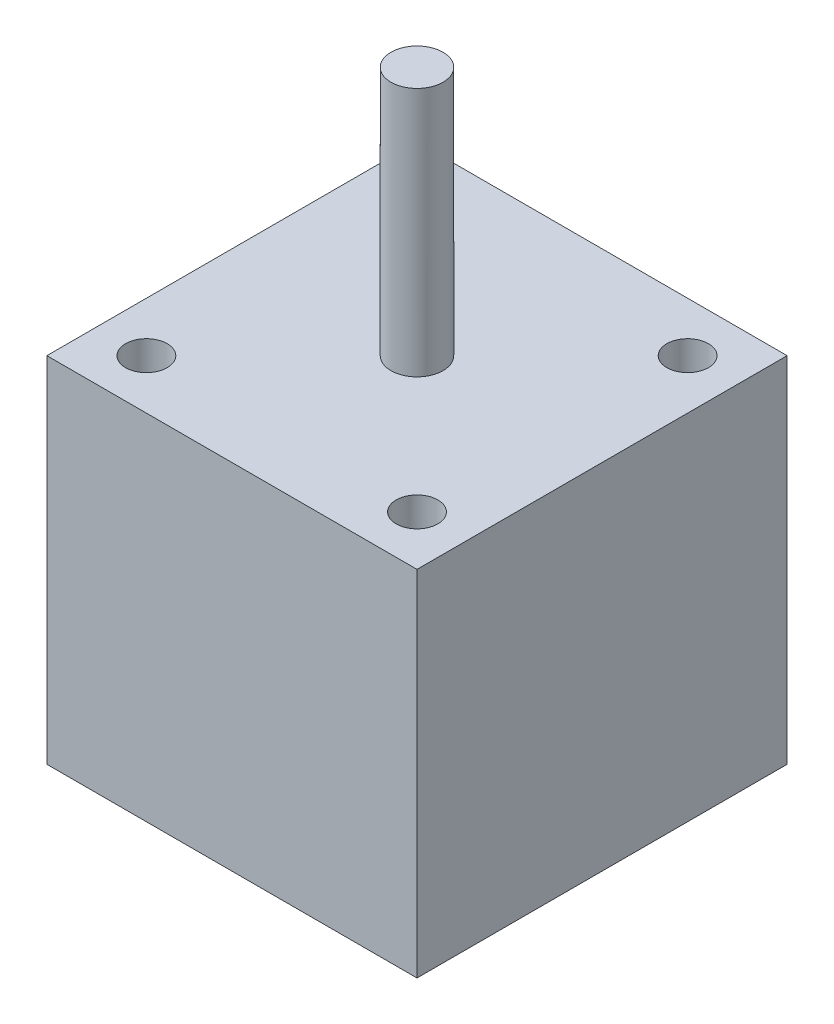
ISO-10303-21;
HEADER;
FILE_DESCRIPTION(('STEP AP214'),'2;1');
FILE_NAME('part.step','',(''),(''),'','','');
FILE_SCHEMA(('AUTOMOTIVE_DESIGN { 1 0 10303 214 1 1 1 1 }'));
ENDSEC;
DATA;
#1=APPLICATION_CONTEXT('core data for automotive mechanical design processes');
#2=APPLICATION_PROTOCOL_DEFINITION('international standard','automotive_design',2000,#1);
#3=PRODUCT_CONTEXT('',#1,'mechanical');
#4=PRODUCT('Part','Part','',(#3));
#5=PRODUCT_RELATED_PRODUCT_CATEGORY('part','',(#4));
#6=PRODUCT_DEFINITION_FORMATION('','',#4);
#7=PRODUCT_DEFINITION_CONTEXT('part definition',#1,'design');
#8=PRODUCT_DEFINITION('design','',#6,#7);
#9=PRODUCT_DEFINITION_SHAPE('','',#8);
#10=(LENGTH_UNIT() NAMED_UNIT(*) SI_UNIT(.MILLI.,.METRE.));
#11=(NAMED_UNIT(*) PLANE_ANGLE_UNIT() SI_UNIT($,.RADIAN.));
#12=(NAMED_UNIT(*) SI_UNIT($,.STERADIAN.) SOLID_ANGLE_UNIT());
#13=UNCERTAINTY_MEASURE_WITH_UNIT(LENGTH_MEASURE(1.E-05),#10,'distance_accuracy_value','');
#14=(GEOMETRIC_REPRESENTATION_CONTEXT(3) GLOBAL_UNCERTAINTY_ASSIGNED_CONTEXT((#13)) GLOBAL_UNIT_ASSIGNED_CONTEXT((#10,
#11,#12)) REPRESENTATION_CONTEXT('',''));
#15=CARTESIAN_POINT('',(0.,0.,0.));
#16=DIRECTION('',(0.,0.,1.));
#17=DIRECTION('',(1.,0.,0.));
#18=AXIS2_PLACEMENT_3D('',#15,#16,#17);
#19=CARTESIAN_POINT('',(17.78,34.,17.78));
#20=DIRECTION('',(-1.,0.,0.));
#21=DIRECTION('',(0.,0.,1.));
#22=AXIS2_PLACEMENT_3D('',#19,#20,#21);
#23=PLANE('',#22);
#24=DIRECTION('',(0.,0.,-1.));
#25=VECTOR('',#24,1.);
#26=CARTESIAN_POINT('',(17.78,0.,17.78));
#27=LINE('',#26,#25);
#28=CARTESIAN_POINT('',(17.78,0.,17.78));
#29=VERTEX_POINT('',#28);
#30=CARTESIAN_POINT('',(17.78,0.,-17.78));
#31=VERTEX_POINT('',#30);
#32=EDGE_CURVE('E112',#29,#31,#27,.T.);
#33=ORIENTED_EDGE('',*,*,#32,.T.);
#34=DIRECTION('',(0.,-1.,0.));
#35=VECTOR('',#34,1.);
#36=CARTESIAN_POINT('',(17.78,34.,-17.78));
#37=LINE('',#36,#35);
#38=CARTESIAN_POINT('',(17.78,34.,-17.78));
#39=VERTEX_POINT('',#38);
#40=EDGE_CURVE('E50',#39,#31,#37,.T.);
#41=ORIENTED_EDGE('',*,*,#40,.F.);
#42=DIRECTION('',(0.,0.,-1.));
#43=VECTOR('',#42,1.);
#44=CARTESIAN_POINT('',(17.78,34.,17.78));
#45=LINE('',#44,#43);
#46=CARTESIAN_POINT('',(17.78,34.,17.78));
#47=VERTEX_POINT('',#46);
#48=EDGE_CURVE('E94',#47,#39,#45,.T.);
#49=ORIENTED_EDGE('',*,*,#48,.F.);
#50=DIRECTION('',(0.,-1.,0.));
#51=VECTOR('',#50,1.);
#52=CARTESIAN_POINT('',(17.78,34.,17.78));
#53=LINE('',#52,#51);
#54=EDGE_CURVE('E108',#47,#29,#53,.T.);
#55=ORIENTED_EDGE('',*,*,#54,.T.);
#56=EDGE_LOOP('',(#33,#41,#49,#55));
#57=FACE_BOUND('',#56,.T.);
#58=ADVANCED_FACE('F41',(#57),#23,.F.);
#59=CARTESIAN_POINT('',(-17.78,34.,-17.78));
#60=DIRECTION('',(0.,0.,1.));
#61=DIRECTION('',(1.,0.,0.));
#62=AXIS2_PLACEMENT_3D('',#59,#60,#61);
#63=PLANE('',#62);
#64=DIRECTION('',(-1.,0.,0.));
#65=VECTOR('',#64,1.);
#66=CARTESIAN_POINT('',(-17.78,0.,-17.78));
#67=LINE('',#66,#65);
#68=CARTESIAN_POINT('',(-17.78,0.,-17.78));
#69=VERTEX_POINT('',#68);
#70=EDGE_CURVE('E100',#31,#69,#67,.T.);
#71=ORIENTED_EDGE('',*,*,#70,.T.);
#72=DIRECTION('',(0.,-1.,0.));
#73=VECTOR('',#72,1.);
#74=CARTESIAN_POINT('',(-17.78,34.,-17.78));
#75=LINE('',#74,#73);
#76=CARTESIAN_POINT('',(-17.78,34.,-17.78));
#77=VERTEX_POINT('',#76);
#78=EDGE_CURVE('E98',#77,#69,#75,.T.);
#79=ORIENTED_EDGE('',*,*,#78,.F.);
#80=DIRECTION('',(-1.,0.,0.));
#81=VECTOR('',#80,1.);
#82=CARTESIAN_POINT('',(-17.78,34.,-17.78));
#83=LINE('',#82,#81);
#84=EDGE_CURVE('E89',#39,#77,#83,.T.);
#85=ORIENTED_EDGE('',*,*,#84,.F.);
#86=ORIENTED_EDGE('',*,*,#40,.T.);
#87=EDGE_LOOP('',(#71,#79,#85,#86));
#88=FACE_BOUND('',#87,.T.);
#89=ADVANCED_FACE('F99',(#88),#63,.F.);
#90=CARTESIAN_POINT('',(-17.78,34.,17.78));
#91=DIRECTION('',(1.,0.,0.));
#92=DIRECTION('',(0.,0.,-1.));
#93=AXIS2_PLACEMENT_3D('',#90,#91,#92);
#94=PLANE('',#93);
#95=DIRECTION('',(0.,0.,1.));
#96=VECTOR('',#95,1.);
#97=CARTESIAN_POINT('',(-17.78,0.,17.78));
#98=LINE('',#97,#96);
#99=CARTESIAN_POINT('',(-17.78,0.,17.78));
#100=VERTEX_POINT('',#99);
#101=EDGE_CURVE('E75',#69,#100,#98,.T.);
#102=ORIENTED_EDGE('',*,*,#101,.T.);
#103=DIRECTION('',(0.,-1.,0.));
#104=VECTOR('',#103,1.);
#105=CARTESIAN_POINT('',(-17.78,34.,17.78));
#106=LINE('',#105,#104);
#107=CARTESIAN_POINT('',(-17.78,34.,17.78));
#108=VERTEX_POINT('',#107);
#109=EDGE_CURVE('E102',#108,#100,#106,.T.);
#110=ORIENTED_EDGE('',*,*,#109,.F.);
#111=DIRECTION('',(0.,0.,1.));
#112=VECTOR('',#111,1.);
#113=CARTESIAN_POINT('',(-17.78,34.,17.78));
#114=LINE('',#113,#112);
#115=EDGE_CURVE('E92',#77,#108,#114,.T.);
#116=ORIENTED_EDGE('',*,*,#115,.F.);
#117=ORIENTED_EDGE('',*,*,#78,.T.);
#118=EDGE_LOOP('',(#102,#110,#116,#117));
#119=FACE_BOUND('',#118,.T.);
#120=ADVANCED_FACE('F104',(#119),#94,.F.);
#121=CARTESIAN_POINT('',(-17.78,34.,17.78));
#122=DIRECTION('',(0.,0.,-1.));
#123=DIRECTION('',(-1.,0.,0.));
#124=AXIS2_PLACEMENT_3D('',#121,#122,#123);
#125=PLANE('',#124);
#126=DIRECTION('',(1.,0.,0.));
#127=VECTOR('',#126,1.);
#128=CARTESIAN_POINT('',(-17.78,0.,17.78));
#129=LINE('',#128,#127);
#130=EDGE_CURVE('E81',#100,#29,#129,.T.);
#131=ORIENTED_EDGE('',*,*,#130,.T.);
#132=ORIENTED_EDGE('',*,*,#54,.F.);
#133=DIRECTION('',(1.,0.,0.));
#134=VECTOR('',#133,1.);
#135=CARTESIAN_POINT('',(-17.78,34.,17.78));
#136=LINE('',#135,#134);
#137=EDGE_CURVE('E58',#108,#47,#136,.T.);
#138=ORIENTED_EDGE('',*,*,#137,.F.);
#139=ORIENTED_EDGE('',*,*,#109,.T.);
#140=EDGE_LOOP('',(#131,#132,#138,#139));
#141=FACE_BOUND('',#140,.T.);
#142=ADVANCED_FACE('F142',(#141),#125,.F.);
#143=CARTESIAN_POINT('',(0.,34.,0.));
#144=DIRECTION('',(0.,-1.,0.));
#145=DIRECTION('',(0.,0.,-1.));
#146=AXIS2_PLACEMENT_3D('',#143,#144,#145);
#147=PLANE('',#146);
#148=CARTESIAN_POINT('',(-13.,34.,13.));
#149=DIRECTION('',(0.,1.,0.));
#150=DIRECTION('',(0.,0.,1.));
#151=AXIS2_PLACEMENT_3D('',#148,#149,#150);
#152=CIRCLE('',#151,2.);
#153=CARTESIAN_POINT('',(-13.,34.,15.));
#154=VERTEX_POINT('',#153);
#155=EDGE_CURVE('E261',#154,#154,#152,.T.);
#156=ORIENTED_EDGE('',*,*,#155,.F.);
#157=EDGE_LOOP('',(#156));
#158=FACE_BOUND('',#157,.T.);
#159=CARTESIAN_POINT('',(13.,34.,13.));
#160=DIRECTION('',(0.,1.,0.));
#161=DIRECTION('',(0.,0.,1.));
#162=AXIS2_PLACEMENT_3D('',#159,#160,#161);
#163=CIRCLE('',#162,2.);
#164=CARTESIAN_POINT('',(13.,34.,15.));
#165=VERTEX_POINT('',#164);
#166=EDGE_CURVE('E260',#165,#165,#163,.T.);
#167=ORIENTED_EDGE('',*,*,#166,.F.);
#168=EDGE_LOOP('',(#167));
#169=FACE_BOUND('',#168,.T.);
#170=CARTESIAN_POINT('',(13.,34.,-13.));
#171=DIRECTION('',(0.,1.,0.));
#172=DIRECTION('',(0.,0.,1.));
#173=AXIS2_PLACEMENT_3D('',#170,#171,#172);
#174=CIRCLE('',#173,2.);
#175=CARTESIAN_POINT('',(13.,34.,-11.));
#176=VERTEX_POINT('',#175);
#177=EDGE_CURVE('E268',#176,#176,#174,.T.);
#178=ORIENTED_EDGE('',*,*,#177,.F.);
#179=EDGE_LOOP('',(#178));
#180=FACE_BOUND('',#179,.T.);
#181=CARTESIAN_POINT('',(-13.,34.,-13.));
#182=DIRECTION('',(0.,1.,0.));
#183=DIRECTION('',(0.,0.,1.));
#184=AXIS2_PLACEMENT_3D('',#181,#182,#183);
#185=CIRCLE('',#184,2.);
#186=CARTESIAN_POINT('',(-13.,34.,-11.));
#187=VERTEX_POINT('',#186);
#188=EDGE_CURVE('E252',#187,#187,#185,.T.);
#189=ORIENTED_EDGE('',*,*,#188,.F.);
#190=EDGE_LOOP('',(#189));
#191=FACE_BOUND('',#190,.T.);
#192=CARTESIAN_POINT('',(0.,34.,0.));
#193=DIRECTION('',(0.,-1.,0.));
#194=DIRECTION('',(0.,0.,-1.));
#195=AXIS2_PLACEMENT_3D('',#192,#193,#194);
#196=CIRCLE('',#195,2.5);
#197=CARTESIAN_POINT('',(0.,34.,-2.5));
#198=VERTEX_POINT('',#197);
#199=EDGE_CURVE('E11',#198,#198,#196,.F.);
#200=ORIENTED_EDGE('',*,*,#199,.F.);
#201=EDGE_LOOP('',(#200));
#202=FACE_BOUND('',#201,.T.);
#203=ORIENTED_EDGE('',*,*,#48,.T.);
#204=ORIENTED_EDGE('',*,*,#84,.T.);
#205=ORIENTED_EDGE('',*,*,#115,.T.);
#206=ORIENTED_EDGE('',*,*,#137,.T.);
#207=EDGE_LOOP('',(#203,#204,#205,#206));
#208=FACE_BOUND('',#207,.T.);
#209=ADVANCED_FACE('F90',(#158,#169,#180,#191,#202,#208),#147,.F.);
#210=CARTESIAN_POINT('',(0.,0.,0.));
#211=DIRECTION('',(0.,-1.,0.));
#212=DIRECTION('',(0.,0.,-1.));
#213=AXIS2_PLACEMENT_3D('',#210,#211,#212);
#214=PLANE('',#213);
#215=CARTESIAN_POINT('',(-13.,0.,13.));
#216=DIRECTION('',(0.,-1.,0.));
#217=DIRECTION('',(0.,0.,-1.));
#218=AXIS2_PLACEMENT_3D('',#215,#216,#217);
#219=CIRCLE('',#218,2.);
#220=CARTESIAN_POINT('',(-13.,0.,11.));
#221=VERTEX_POINT('',#220);
#222=EDGE_CURVE('E257',#221,#221,#219,.F.);
#223=ORIENTED_EDGE('',*,*,#222,.T.);
#224=EDGE_LOOP('',(#223));
#225=FACE_BOUND('',#224,.T.);
#226=CARTESIAN_POINT('',(13.,0.,13.));
#227=DIRECTION('',(0.,-1.,0.));
#228=DIRECTION('',(0.,0.,-1.));
#229=AXIS2_PLACEMENT_3D('',#226,#227,#228);
#230=CIRCLE('',#229,2.);
#231=CARTESIAN_POINT('',(13.,0.,11.));
#232=VERTEX_POINT('',#231);
#233=EDGE_CURVE('E264',#232,#232,#230,.F.);
#234=ORIENTED_EDGE('',*,*,#233,.T.);
#235=EDGE_LOOP('',(#234));
#236=FACE_BOUND('',#235,.T.);
#237=CARTESIAN_POINT('',(13.,0.,-13.));
#238=DIRECTION('',(0.,-1.,0.));
#239=DIRECTION('',(0.,0.,-1.));
#240=AXIS2_PLACEMENT_3D('',#237,#238,#239);
#241=CIRCLE('',#240,2.);
#242=CARTESIAN_POINT('',(13.,0.,-15.));
#243=VERTEX_POINT('',#242);
#244=EDGE_CURVE('E256',#243,#243,#241,.F.);
#245=ORIENTED_EDGE('',*,*,#244,.T.);
#246=EDGE_LOOP('',(#245));
#247=FACE_BOUND('',#246,.T.);
#248=CARTESIAN_POINT('',(-13.,0.,-13.));
#249=DIRECTION('',(0.,-1.,0.));
#250=DIRECTION('',(0.,0.,-1.));
#251=AXIS2_PLACEMENT_3D('',#248,#249,#250);
#252=CIRCLE('',#251,2.);
#253=CARTESIAN_POINT('',(-13.,0.,-15.));
#254=VERTEX_POINT('',#253);
#255=EDGE_CURVE('E247',#254,#254,#252,.F.);
#256=ORIENTED_EDGE('',*,*,#255,.T.);
#257=EDGE_LOOP('',(#256));
#258=FACE_BOUND('',#257,.T.);
#259=CARTESIAN_POINT('',(0.,0.,0.));
#260=DIRECTION('',(0.,-1.,0.));
#261=DIRECTION('',(0.,0.,-1.));
#262=AXIS2_PLACEMENT_3D('',#259,#260,#261);
#263=CIRCLE('',#262,2.5);
#264=CARTESIAN_POINT('',(0.,0.,-2.5));
#265=VERTEX_POINT('',#264);
#266=EDGE_CURVE('E241',#265,#265,#263,.T.);
#267=ORIENTED_EDGE('',*,*,#266,.F.);
#268=EDGE_LOOP('',(#267));
#269=FACE_BOUND('',#268,.T.);
#270=ORIENTED_EDGE('',*,*,#32,.F.);
#271=ORIENTED_EDGE('',*,*,#130,.F.);
#272=ORIENTED_EDGE('',*,*,#101,.F.);
#273=ORIENTED_EDGE('',*,*,#70,.F.);
#274=EDGE_LOOP('',(#270,#271,#272,#273));
#275=FACE_BOUND('',#274,.T.);
#276=ADVANCED_FACE('F130',(#225,#236,#247,#258,#269,#275),#214,.T.);
#277=CARTESIAN_POINT('',(0.,58.,0.));
#278=DIRECTION('',(0.,-1.,0.));
#279=DIRECTION('',(0.,0.,-1.));
#280=AXIS2_PLACEMENT_3D('',#277,#278,#279);
#281=CYLINDRICAL_SURFACE('',#280,2.5);
#282=CARTESIAN_POINT('',(0.,58.,0.));
#283=DIRECTION('',(0.,1.,0.));
#284=DIRECTION('',(0.,0.,1.));
#285=AXIS2_PLACEMENT_3D('',#282,#283,#284);
#286=CIRCLE('',#285,2.5);
#287=CARTESIAN_POINT('',(0.,58.,2.5));
#288=VERTEX_POINT('',#287);
#289=EDGE_CURVE('E116',#288,#288,#286,.T.);
#290=ORIENTED_EDGE('',*,*,#289,.F.);
#291=EDGE_LOOP('',(#290));
#292=FACE_BOUND('',#291,.T.);
#293=ORIENTED_EDGE('',*,*,#199,.T.);
#294=EDGE_LOOP('',(#293));
#295=FACE_BOUND('',#294,.T.);
#296=ADVANCED_FACE('F132',(#292,#295),#281,.T.);
#297=CARTESIAN_POINT('',(0.,58.,0.));
#298=DIRECTION('',(0.,1.,0.));
#299=DIRECTION('',(0.,0.,1.));
#300=AXIS2_PLACEMENT_3D('',#297,#298,#299);
#301=PLANE('',#300);
#302=ORIENTED_EDGE('',*,*,#289,.T.);
#303=EDGE_LOOP('',(#302));
#304=FACE_BOUND('',#303,.T.);
#305=ADVANCED_FACE('F139',(#304),#301,.T.);
#306=CARTESIAN_POINT('',(0.,-12.,0.));
#307=DIRECTION('',(0.,1.,0.));
#308=DIRECTION('',(0.,0.,1.));
#309=AXIS2_PLACEMENT_3D('',#306,#307,#308);
#310=CYLINDRICAL_SURFACE('',#309,2.5);
#311=CARTESIAN_POINT('',(0.,-12.,0.));
#312=DIRECTION('',(0.,-1.,0.));
#313=DIRECTION('',(0.,0.,-1.));
#314=AXIS2_PLACEMENT_3D('',#311,#312,#313);
#315=CIRCLE('',#314,2.5);
#316=CARTESIAN_POINT('',(0.,-12.,-2.5));
#317=VERTEX_POINT('',#316);
#318=EDGE_CURVE('E237',#317,#317,#315,.T.);
#319=ORIENTED_EDGE('',*,*,#318,.F.);
#320=EDGE_LOOP('',(#319));
#321=FACE_BOUND('',#320,.T.);
#322=ORIENTED_EDGE('',*,*,#266,.T.);
#323=EDGE_LOOP('',(#322));
#324=FACE_BOUND('',#323,.T.);
#325=ADVANCED_FACE('F225',(#321,#324),#310,.T.);
#326=CARTESIAN_POINT('',(0.,-12.,0.));
#327=DIRECTION('',(0.,-1.,0.));
#328=DIRECTION('',(0.,0.,-1.));
#329=AXIS2_PLACEMENT_3D('',#326,#327,#328);
#330=PLANE('',#329);
#331=ORIENTED_EDGE('',*,*,#318,.T.);
#332=EDGE_LOOP('',(#331));
#333=FACE_BOUND('',#332,.T.);
#334=ADVANCED_FACE('F172',(#333),#330,.T.);
#335=CARTESIAN_POINT('',(-13.,-5.65685424949237,-13.));
#336=DIRECTION('',(0.,1.,0.));
#337=DIRECTION('',(0.,0.,1.));
#338=AXIS2_PLACEMENT_3D('',#335,#336,#337);
#339=CYLINDRICAL_SURFACE('',#338,2.);
#340=ORIENTED_EDGE('',*,*,#188,.T.);
#341=EDGE_LOOP('',(#340));
#342=FACE_BOUND('',#341,.T.);
#343=ORIENTED_EDGE('',*,*,#255,.F.);
#344=EDGE_LOOP('',(#343));
#345=FACE_BOUND('',#344,.T.);
#346=ADVANCED_FACE('F182',(#342,#345),#339,.F.);
#347=CARTESIAN_POINT('',(13.,-5.65685424949237,-13.));
#348=DIRECTION('',(0.,1.,0.));
#349=DIRECTION('',(0.,0.,1.));
#350=AXIS2_PLACEMENT_3D('',#347,#348,#349);
#351=CYLINDRICAL_SURFACE('',#350,2.);
#352=ORIENTED_EDGE('',*,*,#177,.T.);
#353=EDGE_LOOP('',(#352));
#354=FACE_BOUND('',#353,.T.);
#355=ORIENTED_EDGE('',*,*,#244,.F.);
#356=EDGE_LOOP('',(#355));
#357=FACE_BOUND('',#356,.T.);
#358=ADVANCED_FACE('F187',(#354,#357),#351,.F.);
#359=CARTESIAN_POINT('',(13.,-5.65685424949237,13.));
#360=DIRECTION('',(0.,1.,0.));
#361=DIRECTION('',(0.,0.,1.));
#362=AXIS2_PLACEMENT_3D('',#359,#360,#361);
#363=CYLINDRICAL_SURFACE('',#362,2.);
#364=ORIENTED_EDGE('',*,*,#166,.T.);
#365=EDGE_LOOP('',(#364));
#366=FACE_BOUND('',#365,.T.);
#367=ORIENTED_EDGE('',*,*,#233,.F.);
#368=EDGE_LOOP('',(#367));
#369=FACE_BOUND('',#368,.T.);
#370=ADVANCED_FACE('F197',(#366,#369),#363,.F.);
#371=CARTESIAN_POINT('',(-13.,-5.65685424949237,13.));
#372=DIRECTION('',(0.,1.,0.));
#373=DIRECTION('',(0.,0.,1.));
#374=AXIS2_PLACEMENT_3D('',#371,#372,#373);
#375=CYLINDRICAL_SURFACE('',#374,2.);
#376=ORIENTED_EDGE('',*,*,#155,.T.);
#377=EDGE_LOOP('',(#376));
#378=FACE_BOUND('',#377,.T.);
#379=ORIENTED_EDGE('',*,*,#222,.F.);
#380=EDGE_LOOP('',(#379));
#381=FACE_BOUND('',#380,.T.);
#382=ADVANCED_FACE('F207',(#378,#381),#375,.F.);
#383=CLOSED_SHELL('',(#58,#89,#120,#142,#209,#276,#296,#305,#325,#334,#346,#358,#370,#382));
#384=MANIFOLD_SOLID_BREP('B2',#383);
#385=ADVANCED_BREP_SHAPE_REPRESENTATION('',(#18,#384),#14);
#386=SHAPE_DEFINITION_REPRESENTATION(#9,#385);
ENDSEC;
END-ISO-10303-21;
